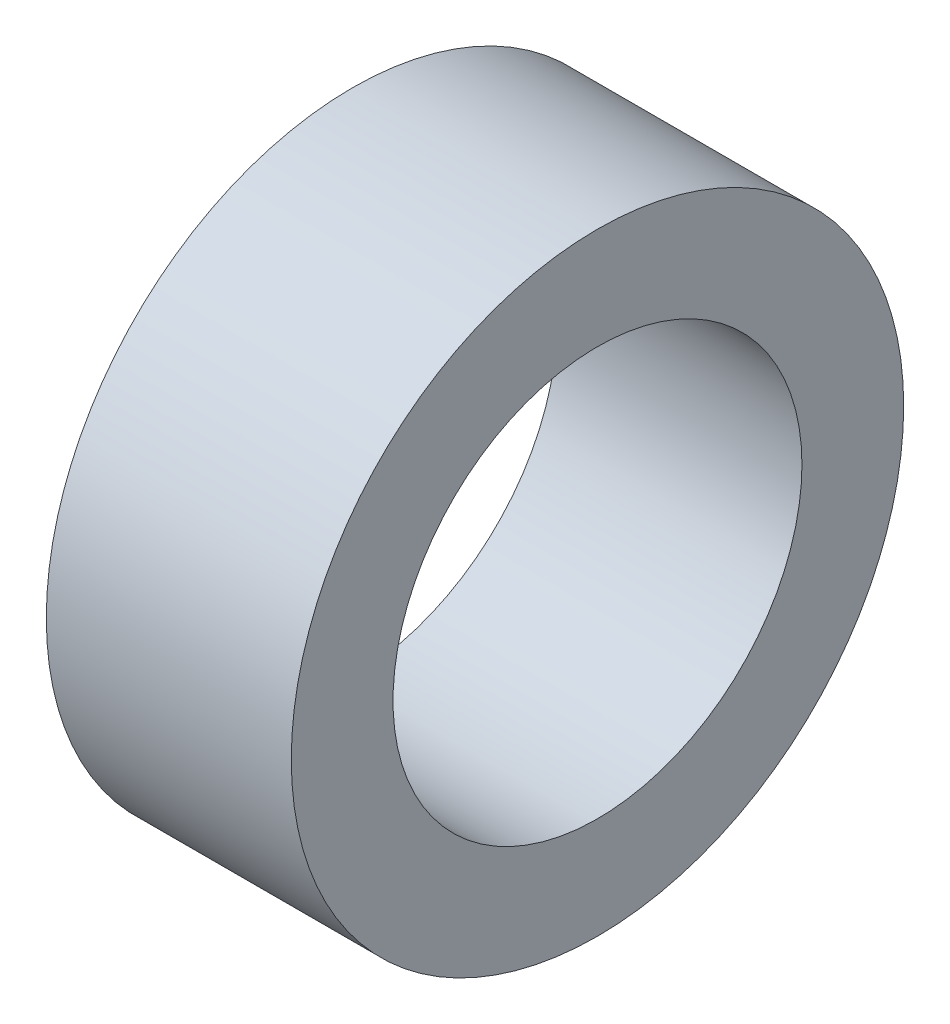
ISO-10303-21;
HEADER;
FILE_DESCRIPTION(('STEP AP214'),'2;1');
FILE_NAME('part.step','',(''),(''),'','','');
FILE_SCHEMA(('AUTOMOTIVE_DESIGN { 1 0 10303 214 1 1 1 1 }'));
ENDSEC;
DATA;
#1=APPLICATION_CONTEXT('core data for automotive mechanical design processes');
#2=APPLICATION_PROTOCOL_DEFINITION('international standard','automotive_design',2000,#1);
#3=PRODUCT_CONTEXT('',#1,'mechanical');
#4=PRODUCT('Part','Part','',(#3));
#5=PRODUCT_RELATED_PRODUCT_CATEGORY('part','',(#4));
#6=PRODUCT_DEFINITION_FORMATION('','',#4);
#7=PRODUCT_DEFINITION_CONTEXT('part definition',#1,'design');
#8=PRODUCT_DEFINITION('design','',#6,#7);
#9=PRODUCT_DEFINITION_SHAPE('','',#8);
#10=(LENGTH_UNIT() NAMED_UNIT(*) SI_UNIT(.MILLI.,.METRE.));
#11=(NAMED_UNIT(*) PLANE_ANGLE_UNIT() SI_UNIT($,.RADIAN.));
#12=(NAMED_UNIT(*) SI_UNIT($,.STERADIAN.) SOLID_ANGLE_UNIT());
#13=UNCERTAINTY_MEASURE_WITH_UNIT(LENGTH_MEASURE(1.E-05),#10,'distance_accuracy_value','');
#14=(GEOMETRIC_REPRESENTATION_CONTEXT(3) GLOBAL_UNCERTAINTY_ASSIGNED_CONTEXT((#13)) GLOBAL_UNIT_ASSIGNED_CONTEXT((#10,
#11,#12)) REPRESENTATION_CONTEXT('',''));
#15=CARTESIAN_POINT('',(0.,0.,0.));
#16=DIRECTION('',(0.,0.,1.));
#17=DIRECTION('',(1.,0.,0.));
#18=AXIS2_PLACEMENT_3D('',#15,#16,#17);
#19=CARTESIAN_POINT('',(3.175,0.,0.));
#20=DIRECTION('',(1.,0.,0.));
#21=DIRECTION('',(0.,0.,-1.));
#22=AXIS2_PLACEMENT_3D('',#19,#20,#21);
#23=PLANE('',#22);
#24=CARTESIAN_POINT('',(3.175,0.,0.));
#25=DIRECTION('',(1.,0.,0.));
#26=DIRECTION('',(0.,0.,-1.));
#27=AXIS2_PLACEMENT_3D('',#24,#25,#26);
#28=CIRCLE('',#27,3.96875);
#29=CARTESIAN_POINT('',(3.175,0.,-3.96875));
#30=VERTEX_POINT('',#29);
#31=EDGE_CURVE('E10',#30,#30,#28,.T.);
#32=ORIENTED_EDGE('',*,*,#31,.T.);
#33=EDGE_LOOP('',(#32));
#34=FACE_BOUND('',#33,.T.);
#35=CARTESIAN_POINT('',(3.175,0.,0.));
#36=DIRECTION('',(1.,0.,0.));
#37=DIRECTION('',(0.,0.,-1.));
#38=AXIS2_PLACEMENT_3D('',#35,#36,#37);
#39=CIRCLE('',#38,2.65);
#40=CARTESIAN_POINT('',(3.175,0.,-2.65));
#41=VERTEX_POINT('',#40);
#42=EDGE_CURVE('E42',#41,#41,#39,.T.);
#43=ORIENTED_EDGE('',*,*,#42,.F.);
#44=EDGE_LOOP('',(#43));
#45=FACE_BOUND('',#44,.T.);
#46=ADVANCED_FACE('F31',(#34,#45),#23,.T.);
#47=CARTESIAN_POINT('',(0.,0.,0.));
#48=DIRECTION('',(1.,0.,0.));
#49=DIRECTION('',(0.,0.,-1.));
#50=AXIS2_PLACEMENT_3D('',#47,#48,#49);
#51=PLANE('',#50);
#52=CARTESIAN_POINT('',(0.,0.,0.));
#53=DIRECTION('',(1.,0.,0.));
#54=DIRECTION('',(0.,0.,-1.));
#55=AXIS2_PLACEMENT_3D('',#52,#53,#54);
#56=CIRCLE('',#55,3.96875);
#57=CARTESIAN_POINT('',(0.,0.,-3.96875));
#58=VERTEX_POINT('',#57);
#59=EDGE_CURVE('E35',#58,#58,#56,.T.);
#60=ORIENTED_EDGE('',*,*,#59,.F.);
#61=EDGE_LOOP('',(#60));
#62=FACE_BOUND('',#61,.T.);
#63=CARTESIAN_POINT('',(0.,0.,0.));
#64=DIRECTION('',(1.,0.,0.));
#65=DIRECTION('',(0.,0.,-1.));
#66=AXIS2_PLACEMENT_3D('',#63,#64,#65);
#67=CIRCLE('',#66,2.65);
#68=CARTESIAN_POINT('',(0.,0.,-2.65));
#69=VERTEX_POINT('',#68);
#70=EDGE_CURVE('E44',#69,#69,#67,.T.);
#71=ORIENTED_EDGE('',*,*,#70,.T.);
#72=EDGE_LOOP('',(#71));
#73=FACE_BOUND('',#72,.T.);
#74=ADVANCED_FACE('F54',(#62,#73),#51,.F.);
#75=CARTESIAN_POINT('',(3.175,0.,0.));
#76=DIRECTION('',(-1.,0.,0.));
#77=DIRECTION('',(0.,0.,1.));
#78=AXIS2_PLACEMENT_3D('',#75,#76,#77);
#79=CYLINDRICAL_SURFACE('',#78,3.96875);
#80=ORIENTED_EDGE('',*,*,#31,.F.);
#81=EDGE_LOOP('',(#80));
#82=FACE_BOUND('',#81,.T.);
#83=ORIENTED_EDGE('',*,*,#59,.T.);
#84=EDGE_LOOP('',(#83));
#85=FACE_BOUND('',#84,.T.);
#86=ADVANCED_FACE('F33',(#82,#85),#79,.T.);
#87=CARTESIAN_POINT('',(3.175,0.,0.));
#88=DIRECTION('',(-1.,0.,0.));
#89=DIRECTION('',(0.,0.,1.));
#90=AXIS2_PLACEMENT_3D('',#87,#88,#89);
#91=CYLINDRICAL_SURFACE('',#90,2.65);
#92=ORIENTED_EDGE('',*,*,#42,.T.);
#93=EDGE_LOOP('',(#92));
#94=FACE_BOUND('',#93,.T.);
#95=ORIENTED_EDGE('',*,*,#70,.F.);
#96=EDGE_LOOP('',(#95));
#97=FACE_BOUND('',#96,.T.);
#98=ADVANCED_FACE('F50',(#94,#97),#91,.F.);
#99=CLOSED_SHELL('',(#46,#74,#86,#98));
#100=MANIFOLD_SOLID_BREP('B2',#99);
#101=ADVANCED_BREP_SHAPE_REPRESENTATION('',(#18,#100),#14);
#102=SHAPE_DEFINITION_REPRESENTATION(#9,#101);
ENDSEC;
END-ISO-10303-21;
